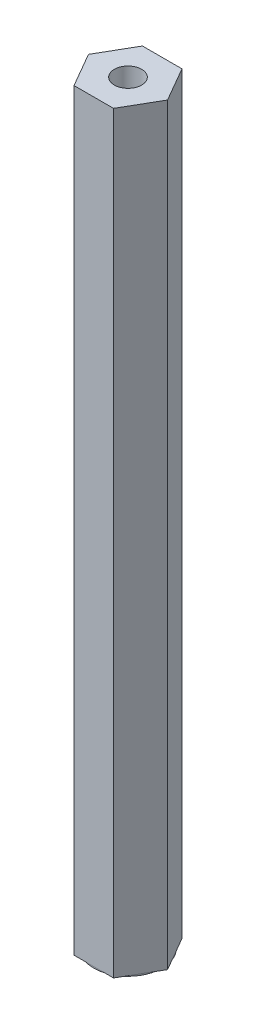
ISO-10303-21;
HEADER;
FILE_DESCRIPTION(('STEP AP214'),'2;1');
FILE_NAME('part.step','',(''),(''),'','','');
FILE_SCHEMA(('AUTOMOTIVE_DESIGN { 1 0 10303 214 1 1 1 1 }'));
ENDSEC;
DATA;
#1=APPLICATION_CONTEXT('core data for automotive mechanical design processes');
#2=APPLICATION_PROTOCOL_DEFINITION('international standard','automotive_design',2000,#1);
#3=PRODUCT_CONTEXT('',#1,'mechanical');
#4=PRODUCT('Part','Part','',(#3));
#5=PRODUCT_RELATED_PRODUCT_CATEGORY('part','',(#4));
#6=PRODUCT_DEFINITION_FORMATION('','',#4);
#7=PRODUCT_DEFINITION_CONTEXT('part definition',#1,'design');
#8=PRODUCT_DEFINITION('design','',#6,#7);
#9=PRODUCT_DEFINITION_SHAPE('','',#8);
#10=(LENGTH_UNIT() NAMED_UNIT(*) SI_UNIT(.MILLI.,.METRE.));
#11=(NAMED_UNIT(*) PLANE_ANGLE_UNIT() SI_UNIT($,.RADIAN.));
#12=(NAMED_UNIT(*) SI_UNIT($,.STERADIAN.) SOLID_ANGLE_UNIT());
#13=UNCERTAINTY_MEASURE_WITH_UNIT(LENGTH_MEASURE(1.E-05),#10,'distance_accuracy_value','');
#14=(GEOMETRIC_REPRESENTATION_CONTEXT(3) GLOBAL_UNCERTAINTY_ASSIGNED_CONTEXT((#13)) GLOBAL_UNIT_ASSIGNED_CONTEXT((#10,
#11,#12)) REPRESENTATION_CONTEXT('',''));
#15=CARTESIAN_POINT('',(0.,0.,0.));
#16=DIRECTION('',(0.,0.,1.));
#17=DIRECTION('',(1.,0.,0.));
#18=AXIS2_PLACEMENT_3D('',#15,#16,#17);
#19=CARTESIAN_POINT('',(0.,0.,0.));
#20=DIRECTION('',(0.,1.,0.));
#21=DIRECTION('',(0.,0.,1.));
#22=AXIS2_PLACEMENT_3D('',#19,#20,#21);
#23=PLANE('',#22);
#24=CARTESIAN_POINT('',(0.,0.,0.));
#25=DIRECTION('',(0.,-1.,0.));
#26=DIRECTION('',(0.,0.,-1.));
#27=AXIS2_PLACEMENT_3D('',#24,#25,#26);
#28=CIRCLE('',#27,6.35000000000001);
#29=CARTESIAN_POINT('',(0.,0.,-6.35000000000001));
#30=VERTEX_POINT('',#29);
#31=CARTESIAN_POINT('',(5.49926131403119,0.,-3.175));
#32=VERTEX_POINT('',#31);
#33=EDGE_CURVE('E50',#30,#32,#28,.T.);
#34=ORIENTED_EDGE('',*,*,#33,.F.);
#35=DIRECTION('',(-1.,0.,0.));
#36=VECTOR('',#35,1.);
#37=CARTESIAN_POINT('',(3.66617420935412,0.,-6.35000000000002));
#38=LINE('',#37,#36);
#39=CARTESIAN_POINT('',(3.66617420935412,0.,-6.35000000000002));
#40=VERTEX_POINT('',#39);
#41=EDGE_CURVE('E133',#40,#30,#38,.T.);
#42=ORIENTED_EDGE('',*,*,#41,.F.);
#43=DIRECTION('',(-0.5,0.,-0.866025403784439));
#44=VECTOR('',#43,1.);
#45=CARTESIAN_POINT('',(7.33234841870825,0.,0.));
#46=LINE('',#45,#44);
#47=EDGE_CURVE('E152',#32,#40,#46,.T.);
#48=ORIENTED_EDGE('',*,*,#47,.F.);
#49=EDGE_LOOP('',(#34,#42,#48));
#50=FACE_BOUND('',#49,.T.);
#51=ADVANCED_FACE('F38',(#50),#23,.F.);
#52=CARTESIAN_POINT('',(5.49926131403119,0.,3.175));
#53=VERTEX_POINT('',#52);
#54=EDGE_CURVE('E11',#32,#53,#28,.T.);
#55=ORIENTED_EDGE('',*,*,#54,.F.);
#56=CARTESIAN_POINT('',(7.33234841870825,0.,0.));
#57=VERTEX_POINT('',#56);
#58=EDGE_CURVE('E150',#57,#32,#46,.T.);
#59=ORIENTED_EDGE('',*,*,#58,.F.);
#60=DIRECTION('',(0.5,0.,-0.866025403784439));
#61=VECTOR('',#60,1.);
#62=CARTESIAN_POINT('',(3.66617420935412,0.,6.35000000000001));
#63=LINE('',#62,#61);
#64=EDGE_CURVE('E172',#53,#57,#63,.T.);
#65=ORIENTED_EDGE('',*,*,#64,.F.);
#66=EDGE_LOOP('',(#55,#59,#65));
#67=FACE_BOUND('',#66,.T.);
#68=ADVANCED_FACE('F267',(#67),#23,.F.);
#69=CARTESIAN_POINT('',(0.,0.,6.35000000000001));
#70=VERTEX_POINT('',#69);
#71=EDGE_CURVE('E48',#53,#70,#28,.T.);
#72=ORIENTED_EDGE('',*,*,#71,.F.);
#73=CARTESIAN_POINT('',(3.66617420935412,0.,6.35000000000001));
#74=VERTEX_POINT('',#73);
#75=EDGE_CURVE('E198',#74,#53,#63,.T.);
#76=ORIENTED_EDGE('',*,*,#75,.F.);
#77=DIRECTION('',(1.,0.,0.));
#78=VECTOR('',#77,1.);
#79=CARTESIAN_POINT('',(-3.66617420935413,0.,6.35000000000001));
#80=LINE('',#79,#78);
#81=EDGE_CURVE('E211',#70,#74,#80,.T.);
#82=ORIENTED_EDGE('',*,*,#81,.F.);
#83=EDGE_LOOP('',(#72,#76,#82));
#84=FACE_BOUND('',#83,.T.);
#85=ADVANCED_FACE('F269',(#84),#23,.F.);
#86=CARTESIAN_POINT('',(-5.4992613140312,0.,3.175));
#87=VERTEX_POINT('',#86);
#88=EDGE_CURVE('E163',#70,#87,#28,.T.);
#89=ORIENTED_EDGE('',*,*,#88,.F.);
#90=CARTESIAN_POINT('',(-3.66617420935413,0.,6.35000000000001));
#91=VERTEX_POINT('',#90);
#92=EDGE_CURVE('E182',#91,#70,#80,.T.);
#93=ORIENTED_EDGE('',*,*,#92,.F.);
#94=DIRECTION('',(0.5,0.,0.866025403784439));
#95=VECTOR('',#94,1.);
#96=CARTESIAN_POINT('',(-7.33234841870826,0.,0.));
#97=LINE('',#96,#95);
#98=EDGE_CURVE('E206',#87,#91,#97,.T.);
#99=ORIENTED_EDGE('',*,*,#98,.F.);
#100=EDGE_LOOP('',(#89,#93,#99));
#101=FACE_BOUND('',#100,.T.);
#102=ADVANCED_FACE('F259',(#101),#23,.F.);
#103=CARTESIAN_POINT('',(-5.4992613140312,0.,-3.175));
#104=VERTEX_POINT('',#103);
#105=EDGE_CURVE('E160',#87,#104,#28,.T.);
#106=ORIENTED_EDGE('',*,*,#105,.F.);
#107=CARTESIAN_POINT('',(-7.33234841870826,0.,0.));
#108=VERTEX_POINT('',#107);
#109=EDGE_CURVE('E207',#108,#87,#97,.T.);
#110=ORIENTED_EDGE('',*,*,#109,.F.);
#111=DIRECTION('',(-0.5,0.,0.866025403784439));
#112=VECTOR('',#111,1.);
#113=CARTESIAN_POINT('',(-3.66617420935413,0.,-6.35000000000002));
#114=LINE('',#113,#112);
#115=EDGE_CURVE('E144',#104,#108,#114,.T.);
#116=ORIENTED_EDGE('',*,*,#115,.F.);
#117=EDGE_LOOP('',(#106,#110,#116));
#118=FACE_BOUND('',#117,.T.);
#119=ADVANCED_FACE('F255',(#118),#23,.F.);
#120=CARTESIAN_POINT('',(3.66617420935412,139.7,6.35000000000001));
#121=DIRECTION('',(-0.866025403784439,0.,-0.5));
#122=DIRECTION('',(-0.5,0.,0.866025403784439));
#123=AXIS2_PLACEMENT_3D('',#120,#121,#122);
#124=PLANE('',#123);
#125=ORIENTED_EDGE('',*,*,#75,.T.);
#126=ORIENTED_EDGE('',*,*,#64,.T.);
#127=DIRECTION('',(0.,-1.,0.));
#128=VECTOR('',#127,1.);
#129=CARTESIAN_POINT('',(7.33234841870825,139.7,0.));
#130=LINE('',#129,#128);
#131=CARTESIAN_POINT('',(7.33234841870825,139.7,0.));
#132=VERTEX_POINT('',#131);
#133=EDGE_CURVE('E42',#132,#57,#130,.T.);
#134=ORIENTED_EDGE('',*,*,#133,.F.);
#135=DIRECTION('',(0.5,0.,-0.866025403784439));
#136=VECTOR('',#135,1.);
#137=CARTESIAN_POINT('',(3.66617420935412,139.7,6.35000000000001));
#138=LINE('',#137,#136);
#139=CARTESIAN_POINT('',(3.66617420935412,139.7,6.35000000000001));
#140=VERTEX_POINT('',#139);
#141=EDGE_CURVE('E177',#140,#132,#138,.T.);
#142=ORIENTED_EDGE('',*,*,#141,.F.);
#143=DIRECTION('',(0.,-1.,0.));
#144=VECTOR('',#143,1.);
#145=CARTESIAN_POINT('',(3.66617420935412,139.7,6.35000000000001));
#146=LINE('',#145,#144);
#147=EDGE_CURVE('E197',#140,#74,#146,.T.);
#148=ORIENTED_EDGE('',*,*,#147,.T.);
#149=EDGE_LOOP('',(#125,#126,#134,#142,#148));
#150=FACE_BOUND('',#149,.T.);
#151=ADVANCED_FACE('F40',(#150),#124,.F.);
#152=CARTESIAN_POINT('',(7.33234841870825,139.7,0.));
#153=DIRECTION('',(-0.866025403784439,0.,0.5));
#154=DIRECTION('',(0.5,0.,0.866025403784439));
#155=AXIS2_PLACEMENT_3D('',#152,#153,#154);
#156=PLANE('',#155);
#157=ORIENTED_EDGE('',*,*,#58,.T.);
#158=ORIENTED_EDGE('',*,*,#47,.T.);
#159=DIRECTION('',(0.,-1.,0.));
#160=VECTOR('',#159,1.);
#161=CARTESIAN_POINT('',(3.66617420935412,139.7,-6.35000000000002));
#162=LINE('',#161,#160);
#163=CARTESIAN_POINT('',(3.66617420935412,139.7,-6.35000000000002));
#164=VERTEX_POINT('',#163);
#165=EDGE_CURVE('E140',#164,#40,#162,.T.);
#166=ORIENTED_EDGE('',*,*,#165,.F.);
#167=DIRECTION('',(-0.5,0.,-0.866025403784439));
#168=VECTOR('',#167,1.);
#169=CARTESIAN_POINT('',(7.33234841870825,139.7,0.));
#170=LINE('',#169,#168);
#171=EDGE_CURVE('E181',#132,#164,#170,.T.);
#172=ORIENTED_EDGE('',*,*,#171,.F.);
#173=ORIENTED_EDGE('',*,*,#133,.T.);
#174=EDGE_LOOP('',(#157,#158,#166,#172,#173));
#175=FACE_BOUND('',#174,.T.);
#176=ADVANCED_FACE('F238',(#175),#156,.F.);
#177=CARTESIAN_POINT('',(3.66617420935412,139.7,-6.35000000000002));
#178=DIRECTION('',(0.,0.,1.));
#179=DIRECTION('',(1.,0.,0.));
#180=AXIS2_PLACEMENT_3D('',#177,#178,#179);
#181=PLANE('',#180);
#182=ORIENTED_EDGE('',*,*,#41,.T.);
#183=CARTESIAN_POINT('',(-3.66617420935413,0.,-6.35000000000002));
#184=VERTEX_POINT('',#183);
#185=EDGE_CURVE('E136',#30,#184,#38,.T.);
#186=ORIENTED_EDGE('',*,*,#185,.T.);
#187=DIRECTION('',(0.,-1.,0.));
#188=VECTOR('',#187,1.);
#189=CARTESIAN_POINT('',(-3.66617420935413,139.7,-6.35000000000002));
#190=LINE('',#189,#188);
#191=CARTESIAN_POINT('',(-3.66617420935413,139.7,-6.35000000000002));
#192=VERTEX_POINT('',#191);
#193=EDGE_CURVE('E226',#192,#184,#190,.T.);
#194=ORIENTED_EDGE('',*,*,#193,.F.);
#195=DIRECTION('',(-1.,0.,0.));
#196=VECTOR('',#195,1.);
#197=CARTESIAN_POINT('',(3.66617420935412,139.7,-6.35000000000002));
#198=LINE('',#197,#196);
#199=EDGE_CURVE('E185',#164,#192,#198,.T.);
#200=ORIENTED_EDGE('',*,*,#199,.F.);
#201=ORIENTED_EDGE('',*,*,#165,.T.);
#202=EDGE_LOOP('',(#182,#186,#194,#200,#201));
#203=FACE_BOUND('',#202,.T.);
#204=ADVANCED_FACE('F134',(#203),#181,.F.);
#205=CARTESIAN_POINT('',(-3.66617420935413,139.7,-6.35000000000002));
#206=DIRECTION('',(0.866025403784439,0.,0.5));
#207=DIRECTION('',(0.5,0.,-0.866025403784439));
#208=AXIS2_PLACEMENT_3D('',#205,#206,#207);
#209=PLANE('',#208);
#210=EDGE_CURVE('E148',#184,#104,#114,.T.);
#211=ORIENTED_EDGE('',*,*,#210,.T.);
#212=ORIENTED_EDGE('',*,*,#115,.T.);
#213=DIRECTION('',(0.,-1.,0.));
#214=VECTOR('',#213,1.);
#215=CARTESIAN_POINT('',(-7.33234841870826,139.7,0.));
#216=LINE('',#215,#214);
#217=CARTESIAN_POINT('',(-7.33234841870826,139.7,0.));
#218=VERTEX_POINT('',#217);
#219=EDGE_CURVE('E222',#218,#108,#216,.T.);
#220=ORIENTED_EDGE('',*,*,#219,.F.);
#221=DIRECTION('',(-0.5,0.,0.866025403784439));
#222=VECTOR('',#221,1.);
#223=CARTESIAN_POINT('',(-3.66617420935413,139.7,-6.35000000000002));
#224=LINE('',#223,#222);
#225=EDGE_CURVE('E188',#192,#218,#224,.T.);
#226=ORIENTED_EDGE('',*,*,#225,.F.);
#227=ORIENTED_EDGE('',*,*,#193,.T.);
#228=EDGE_LOOP('',(#211,#212,#220,#226,#227));
#229=FACE_BOUND('',#228,.T.);
#230=ADVANCED_FACE('F231',(#229),#209,.F.);
#231=CARTESIAN_POINT('',(-7.33234841870826,139.7,0.));
#232=DIRECTION('',(0.866025403784439,0.,-0.5));
#233=DIRECTION('',(-0.5,0.,-0.866025403784439));
#234=AXIS2_PLACEMENT_3D('',#231,#232,#233);
#235=PLANE('',#234);
#236=ORIENTED_EDGE('',*,*,#109,.T.);
#237=ORIENTED_EDGE('',*,*,#98,.T.);
#238=DIRECTION('',(0.,-1.,0.));
#239=VECTOR('',#238,1.);
#240=CARTESIAN_POINT('',(-3.66617420935413,139.7,6.35000000000001));
#241=LINE('',#240,#239);
#242=CARTESIAN_POINT('',(-3.66617420935413,139.7,6.35000000000001));
#243=VERTEX_POINT('',#242);
#244=EDGE_CURVE('E218',#243,#91,#241,.T.);
#245=ORIENTED_EDGE('',*,*,#244,.F.);
#246=DIRECTION('',(0.5,0.,0.866025403784439));
#247=VECTOR('',#246,1.);
#248=CARTESIAN_POINT('',(-7.33234841870826,139.7,0.));
#249=LINE('',#248,#247);
#250=EDGE_CURVE('E191',#218,#243,#249,.T.);
#251=ORIENTED_EDGE('',*,*,#250,.F.);
#252=ORIENTED_EDGE('',*,*,#219,.T.);
#253=EDGE_LOOP('',(#236,#237,#245,#251,#252));
#254=FACE_BOUND('',#253,.T.);
#255=ADVANCED_FACE('F253',(#254),#235,.F.);
#256=CARTESIAN_POINT('',(-3.66617420935413,139.7,6.35000000000001));
#257=DIRECTION('',(0.,0.,-1.));
#258=DIRECTION('',(-1.,0.,0.));
#259=AXIS2_PLACEMENT_3D('',#256,#257,#258);
#260=PLANE('',#259);
#261=ORIENTED_EDGE('',*,*,#92,.T.);
#262=ORIENTED_EDGE('',*,*,#81,.T.);
#263=ORIENTED_EDGE('',*,*,#147,.F.);
#264=DIRECTION('',(1.,0.,0.));
#265=VECTOR('',#264,1.);
#266=CARTESIAN_POINT('',(-3.66617420935413,139.7,6.35000000000001));
#267=LINE('',#266,#265);
#268=EDGE_CURVE('E194',#243,#140,#267,.T.);
#269=ORIENTED_EDGE('',*,*,#268,.F.);
#270=ORIENTED_EDGE('',*,*,#244,.T.);
#271=EDGE_LOOP('',(#261,#262,#263,#269,#270));
#272=FACE_BOUND('',#271,.T.);
#273=ADVANCED_FACE('F263',(#272),#260,.F.);
#274=CARTESIAN_POINT('',(0.,139.7,0.));
#275=DIRECTION('',(0.,1.,0.));
#276=DIRECTION('',(0.,0.,1.));
#277=AXIS2_PLACEMENT_3D('',#274,#275,#276);
#278=PLANE('',#277);
#279=CARTESIAN_POINT('',(0.,139.7,0.));
#280=DIRECTION('',(0.,1.,0.));
#281=DIRECTION('',(0.,0.,1.));
#282=AXIS2_PLACEMENT_3D('',#279,#280,#281);
#283=CIRCLE('',#282,2.54);
#284=CARTESIAN_POINT('',(0.,139.7,2.54));
#285=VERTEX_POINT('',#284);
#286=EDGE_CURVE('E173',#285,#285,#283,.T.);
#287=ORIENTED_EDGE('',*,*,#286,.F.);
#288=EDGE_LOOP('',(#287));
#289=FACE_BOUND('',#288,.T.);
#290=ORIENTED_EDGE('',*,*,#141,.T.);
#291=ORIENTED_EDGE('',*,*,#171,.T.);
#292=ORIENTED_EDGE('',*,*,#199,.T.);
#293=ORIENTED_EDGE('',*,*,#225,.T.);
#294=ORIENTED_EDGE('',*,*,#250,.T.);
#295=ORIENTED_EDGE('',*,*,#268,.T.);
#296=EDGE_LOOP('',(#290,#291,#292,#293,#294,#295));
#297=FACE_BOUND('',#296,.T.);
#298=ADVANCED_FACE('F234',(#289,#297),#278,.T.);
#299=EDGE_CURVE('E69',#104,#30,#28,.T.);
#300=ORIENTED_EDGE('',*,*,#299,.F.);
#301=ORIENTED_EDGE('',*,*,#210,.F.);
#302=ORIENTED_EDGE('',*,*,#185,.F.);
#303=EDGE_LOOP('',(#300,#301,#302));
#304=FACE_BOUND('',#303,.T.);
#305=ADVANCED_FACE('F146',(#304),#23,.F.);
#306=CARTESIAN_POINT('',(0.,114.3,0.));
#307=DIRECTION('',(0.,1.,0.));
#308=DIRECTION('',(0.,0.,1.));
#309=AXIS2_PLACEMENT_3D('',#306,#307,#308);
#310=CYLINDRICAL_SURFACE('',#309,2.54);
#311=CARTESIAN_POINT('',(0.,114.3,0.));
#312=DIRECTION('',(0.,1.,0.));
#313=DIRECTION('',(0.,0.,1.));
#314=AXIS2_PLACEMENT_3D('',#311,#312,#313);
#315=CIRCLE('',#314,2.54);
#316=CARTESIAN_POINT('',(0.,114.3,2.54));
#317=VERTEX_POINT('',#316);
#318=EDGE_CURVE('E168',#317,#317,#315,.T.);
#319=ORIENTED_EDGE('',*,*,#318,.F.);
#320=EDGE_LOOP('',(#319));
#321=FACE_BOUND('',#320,.T.);
#322=ORIENTED_EDGE('',*,*,#286,.T.);
#323=EDGE_LOOP('',(#322));
#324=FACE_BOUND('',#323,.T.);
#325=ADVANCED_FACE('F279',(#321,#324),#310,.F.);
#326=CARTESIAN_POINT('',(0.,114.3,0.));
#327=DIRECTION('',(0.,1.,0.));
#328=DIRECTION('',(0.,0.,1.));
#329=AXIS2_PLACEMENT_3D('',#326,#327,#328);
#330=PLANE('',#329);
#331=ORIENTED_EDGE('',*,*,#318,.T.);
#332=EDGE_LOOP('',(#331));
#333=FACE_BOUND('',#332,.T.);
#334=ADVANCED_FACE('F320',(#333),#330,.T.);
#335=CARTESIAN_POINT('',(0.,-0.254,0.));
#336=DIRECTION('',(0.,1.,0.));
#337=DIRECTION('',(0.,0.,1.));
#338=AXIS2_PLACEMENT_3D('',#335,#336,#337);
#339=CYLINDRICAL_SURFACE('',#338,6.35000000000001);
#340=CARTESIAN_POINT('',(0.,-0.254,0.));
#341=DIRECTION('',(0.,-1.,0.));
#342=DIRECTION('',(0.,0.,-1.));
#343=AXIS2_PLACEMENT_3D('',#340,#341,#342);
#344=CIRCLE('',#343,6.35000000000001);
#345=CARTESIAN_POINT('',(0.,-0.254,-6.35000000000001));
#346=VERTEX_POINT('',#345);
#347=EDGE_CURVE('E156',#346,#346,#344,.T.);
#348=ORIENTED_EDGE('',*,*,#347,.F.);
#349=EDGE_LOOP('',(#348));
#350=FACE_BOUND('',#349,.T.);
#351=ORIENTED_EDGE('',*,*,#33,.T.);
#352=ORIENTED_EDGE('',*,*,#54,.T.);
#353=ORIENTED_EDGE('',*,*,#71,.T.);
#354=ORIENTED_EDGE('',*,*,#88,.T.);
#355=ORIENTED_EDGE('',*,*,#105,.T.);
#356=ORIENTED_EDGE('',*,*,#299,.T.);
#357=EDGE_LOOP('',(#351,#352,#353,#354,#355,#356));
#358=FACE_BOUND('',#357,.T.);
#359=ADVANCED_FACE('F158',(#350,#358),#339,.T.);
#360=CARTESIAN_POINT('',(0.,-0.254,0.));
#361=DIRECTION('',(0.,-1.,0.));
#362=DIRECTION('',(0.,0.,-1.));
#363=AXIS2_PLACEMENT_3D('',#360,#361,#362);
#364=PLANE('',#363);
#365=ORIENTED_EDGE('',*,*,#347,.T.);
#366=EDGE_LOOP('',(#365));
#367=FACE_BOUND('',#366,.T.);
#368=ADVANCED_FACE('F361',(#367),#364,.T.);
#369=CLOSED_SHELL('',(#51,#68,#85,#102,#119,#151,#176,#204,#230,#255,#273,#298,#305,#325,#334,
#359,#368));
#370=MANIFOLD_SOLID_BREP('B2',#369);
#371=ADVANCED_BREP_SHAPE_REPRESENTATION('',(#18,#370),#14);
#372=SHAPE_DEFINITION_REPRESENTATION(#9,#371);
ENDSEC;
END-ISO-10303-21;
